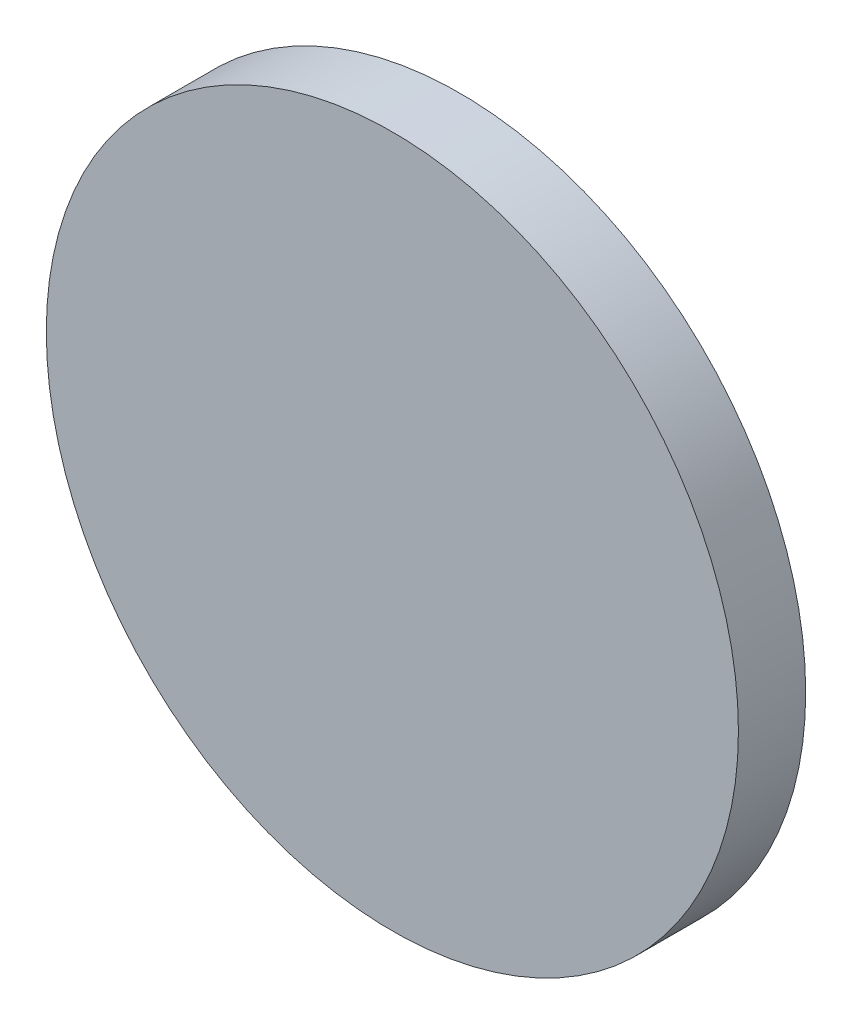
ISO-10303-21;
HEADER;
FILE_DESCRIPTION(('STEP AP214'),'2;1');
FILE_NAME('part.step','',(''),(''),'','','');
FILE_SCHEMA(('AUTOMOTIVE_DESIGN { 1 0 10303 214 1 1 1 1 }'));
ENDSEC;
DATA;
#1=APPLICATION_CONTEXT('core data for automotive mechanical design processes');
#2=APPLICATION_PROTOCOL_DEFINITION('international standard','automotive_design',2000,#1);
#3=PRODUCT_CONTEXT('',#1,'mechanical');
#4=PRODUCT('Part','Part','',(#3));
#5=PRODUCT_RELATED_PRODUCT_CATEGORY('part','',(#4));
#6=PRODUCT_DEFINITION_FORMATION('','',#4);
#7=PRODUCT_DEFINITION_CONTEXT('part definition',#1,'design');
#8=PRODUCT_DEFINITION('design','',#6,#7);
#9=PRODUCT_DEFINITION_SHAPE('','',#8);
#10=(LENGTH_UNIT() NAMED_UNIT(*) SI_UNIT(.MILLI.,.METRE.));
#11=(NAMED_UNIT(*) PLANE_ANGLE_UNIT() SI_UNIT($,.RADIAN.));
#12=(NAMED_UNIT(*) SI_UNIT($,.STERADIAN.) SOLID_ANGLE_UNIT());
#13=UNCERTAINTY_MEASURE_WITH_UNIT(LENGTH_MEASURE(1.E-05),#10,'distance_accuracy_value','');
#14=(GEOMETRIC_REPRESENTATION_CONTEXT(3) GLOBAL_UNCERTAINTY_ASSIGNED_CONTEXT((#13)) GLOBAL_UNIT_ASSIGNED_CONTEXT((#10,
#11,#12)) REPRESENTATION_CONTEXT('',''));
#15=CARTESIAN_POINT('',(0.,0.,0.));
#16=DIRECTION('',(0.,0.,1.));
#17=DIRECTION('',(1.,0.,0.));
#18=AXIS2_PLACEMENT_3D('',#15,#16,#17);
#19=CARTESIAN_POINT('',(2.0031124878754,1.99113616794209,0.8));
#20=DIRECTION('',(0.,0.,1.));
#21=DIRECTION('',(1.,0.,0.));
#22=AXIS2_PLACEMENT_3D('',#19,#20,#21);
#23=PLANE('',#22);
#24=CARTESIAN_POINT('',(2.0031124878754,1.99113616794209,0.8));
#25=DIRECTION('',(0.,0.,-1.));
#26=DIRECTION('',(-1.,0.,0.));
#27=AXIS2_PLACEMENT_3D('',#24,#25,#26);
#28=CIRCLE('',#27,0.257190335341088);
#29=CARTESIAN_POINT('',(1.74592215253431,1.99113616794209,0.8));
#30=VERTEX_POINT('',#29);
#31=EDGE_CURVE('E17',#30,#30,#28,.T.);
#32=ORIENTED_EDGE('',*,*,#31,.F.);
#33=EDGE_LOOP('',(#32));
#34=FACE_BOUND('',#33,.T.);
#35=ADVANCED_FACE('F14',(#34),#23,.T.);
#36=CARTESIAN_POINT('',(2.0031124878754,1.99113616794209,0.8));
#37=DIRECTION('',(0.,0.,-1.));
#38=DIRECTION('',(-1.,0.,0.));
#39=AXIS2_PLACEMENT_3D('',#36,#37,#38);
#40=CYLINDRICAL_SURFACE('',#39,0.257190335341088);
#41=ORIENTED_EDGE('',*,*,#31,.T.);
#42=EDGE_LOOP('',(#41));
#43=FACE_BOUND('',#42,.T.);
#44=CARTESIAN_POINT('',(2.0031124878754,1.99113616794209,0.75));
#45=DIRECTION('',(0.,0.,-1.));
#46=DIRECTION('',(-1.,0.,0.));
#47=AXIS2_PLACEMENT_3D('',#44,#45,#46);
#48=CIRCLE('',#47,0.257190335341088);
#49=CARTESIAN_POINT('',(1.74592215253431,1.99113616794209,0.75));
#50=VERTEX_POINT('',#49);
#51=EDGE_CURVE('E10',#50,#50,#48,.F.);
#52=ORIENTED_EDGE('',*,*,#51,.T.);
#53=EDGE_LOOP('',(#52));
#54=FACE_BOUND('',#53,.T.);
#55=ADVANCED_FACE('F26',(#43,#54),#40,.T.);
#56=CARTESIAN_POINT('',(2.0031124878754,1.99113616794209,0.75));
#57=DIRECTION('',(0.,0.,1.));
#58=DIRECTION('',(1.,0.,0.));
#59=AXIS2_PLACEMENT_3D('',#56,#57,#58);
#60=PLANE('',#59);
#61=ORIENTED_EDGE('',*,*,#51,.F.);
#62=EDGE_LOOP('',(#61));
#63=FACE_BOUND('',#62,.T.);
#64=ADVANCED_FACE('F33',(#63),#60,.F.);
#65=CLOSED_SHELL('',(#35,#55,#64));
#66=MANIFOLD_SOLID_BREP('B1',#65);
#67=ADVANCED_BREP_SHAPE_REPRESENTATION('',(#18,#66),#14);
#68=SHAPE_DEFINITION_REPRESENTATION(#9,#67);
ENDSEC;
END-ISO-10303-21;
